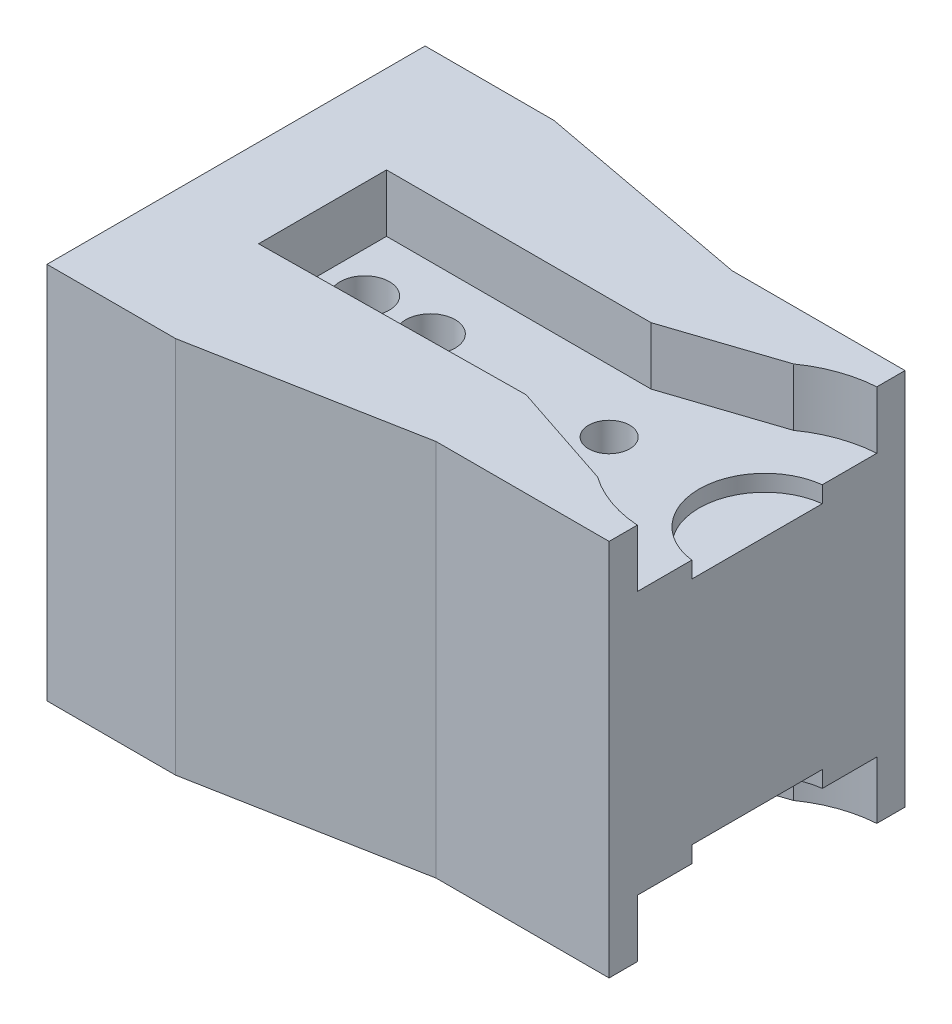
ISO-10303-21;
HEADER;
FILE_DESCRIPTION(('STEP AP214'),'2;1');
FILE_NAME('part.step','',(''),(''),'','','');
FILE_SCHEMA(('AUTOMOTIVE_DESIGN { 1 0 10303 214 1 1 1 1 }'));
ENDSEC;
DATA;
#1=APPLICATION_CONTEXT('core data for automotive mechanical design processes');
#2=APPLICATION_PROTOCOL_DEFINITION('international standard','automotive_design',2000,#1);
#3=PRODUCT_CONTEXT('',#1,'mechanical');
#4=PRODUCT('Part','Part','',(#3));
#5=PRODUCT_RELATED_PRODUCT_CATEGORY('part','',(#4));
#6=PRODUCT_DEFINITION_FORMATION('','',#4);
#7=PRODUCT_DEFINITION_CONTEXT('part definition',#1,'design');
#8=PRODUCT_DEFINITION('design','',#6,#7);
#9=PRODUCT_DEFINITION_SHAPE('','',#8);
#10=(LENGTH_UNIT() NAMED_UNIT(*) SI_UNIT(.MILLI.,.METRE.));
#11=(NAMED_UNIT(*) PLANE_ANGLE_UNIT() SI_UNIT($,.RADIAN.));
#12=(NAMED_UNIT(*) SI_UNIT($,.STERADIAN.) SOLID_ANGLE_UNIT());
#13=UNCERTAINTY_MEASURE_WITH_UNIT(LENGTH_MEASURE(1.E-05),#10,'distance_accuracy_value','');
#14=(GEOMETRIC_REPRESENTATION_CONTEXT(3) GLOBAL_UNCERTAINTY_ASSIGNED_CONTEXT((#13)) GLOBAL_UNIT_ASSIGNED_CONTEXT((#10,
#11,#12)) REPRESENTATION_CONTEXT('',''));
#15=CARTESIAN_POINT('',(0.,0.,0.));
#16=DIRECTION('',(0.,0.,1.));
#17=DIRECTION('',(1.,0.,0.));
#18=AXIS2_PLACEMENT_3D('',#15,#16,#17);
#19=CARTESIAN_POINT('',(7.30190903478725,8.,0.));
#20=DIRECTION('',(0.,-1.,0.));
#21=DIRECTION('',(0.,0.,-1.));
#22=AXIS2_PLACEMENT_3D('',#19,#20,#21);
#23=CYLINDRICAL_SURFACE('',#22,4.00000000000001);
#24=DIRECTION('',(0.,-1.,0.));
#25=VECTOR('',#24,1.);
#26=CARTESIAN_POINT('',(6.82431458586507,8.,-3.97138559477152));
#27=LINE('',#26,#25);
#28=CARTESIAN_POINT('',(6.82431458586507,-7.,-3.97138559477152));
#29=VERTEX_POINT('',#28);
#30=CARTESIAN_POINT('',(6.82431458586507,-8.,-3.97138559477152));
#31=VERTEX_POINT('',#30);
#32=EDGE_CURVE('E242',#29,#31,#27,.T.);
#33=ORIENTED_EDGE('',*,*,#32,.F.);
#34=CARTESIAN_POINT('',(7.30190903478725,-7.,0.));
#35=DIRECTION('',(0.,1.,0.));
#36=DIRECTION('',(0.,0.,1.));
#37=AXIS2_PLACEMENT_3D('',#34,#35,#36);
#38=CIRCLE('',#37,4.00000000000001);
#39=CARTESIAN_POINT('',(6.82431458586507,-7.,3.97138559477152));
#40=VERTEX_POINT('',#39);
#41=EDGE_CURVE('E225',#29,#40,#38,.T.);
#42=ORIENTED_EDGE('',*,*,#41,.T.);
#43=DIRECTION('',(0.,-1.,0.));
#44=VECTOR('',#43,1.);
#45=CARTESIAN_POINT('',(6.82431458586507,8.,3.97138559477152));
#46=LINE('',#45,#44);
#47=CARTESIAN_POINT('',(6.82431458586507,-8.,3.97138559477152));
#48=VERTEX_POINT('',#47);
#49=EDGE_CURVE('E241',#40,#48,#46,.T.);
#50=ORIENTED_EDGE('',*,*,#49,.T.);
#51=CARTESIAN_POINT('',(7.30190903478725,-8.,0.));
#52=DIRECTION('',(0.,1.,0.));
#53=DIRECTION('',(0.,0.,1.));
#54=AXIS2_PLACEMENT_3D('',#51,#52,#53);
#55=CIRCLE('',#54,4.00000000000001);
#56=EDGE_CURVE('E413',#31,#48,#55,.T.);
#57=ORIENTED_EDGE('',*,*,#56,.F.);
#58=EDGE_LOOP('',(#33,#42,#50,#57));
#59=FACE_BOUND('',#58,.T.);
#60=ADVANCED_FACE('F33',(#59),#23,.F.);
#61=CARTESIAN_POINT('',(7.30190903478725,11.5,0.));
#62=DIRECTION('',(0.,-1.,0.));
#63=DIRECTION('',(0.,0.,-1.));
#64=AXIS2_PLACEMENT_3D('',#61,#62,#63);
#65=CYLINDRICAL_SURFACE('',#64,7.3);
#66=DIRECTION('',(0.,-1.,0.));
#67=VECTOR('',#66,1.);
#68=CARTESIAN_POINT('',(3.08203544869912,11.5,5.9567329063368));
#69=LINE('',#68,#67);
#70=CARTESIAN_POINT('',(3.08203544869912,-8.,5.9567329063368));
#71=VERTEX_POINT('',#70);
#72=CARTESIAN_POINT('',(3.08203544869912,-11.5,5.9567329063368));
#73=VERTEX_POINT('',#72);
#74=EDGE_CURVE('E41',#71,#73,#69,.T.);
#75=ORIENTED_EDGE('',*,*,#74,.F.);
#76=CARTESIAN_POINT('',(7.30190903478725,-8.,0.));
#77=DIRECTION('',(0.,1.,0.));
#78=DIRECTION('',(0.,0.,1.));
#79=AXIS2_PLACEMENT_3D('',#76,#77,#78);
#80=CIRCLE('',#79,7.3);
#81=CARTESIAN_POINT('',(6.82431458586507,-8.,7.28436020130517));
#82=VERTEX_POINT('',#81);
#83=EDGE_CURVE('E419',#71,#82,#80,.T.);
#84=ORIENTED_EDGE('',*,*,#83,.T.);
#85=DIRECTION('',(0.,-1.,0.));
#86=VECTOR('',#85,1.);
#87=CARTESIAN_POINT('',(6.82431458586507,11.5,7.28436020130517));
#88=LINE('',#87,#86);
#89=CARTESIAN_POINT('',(6.82431458586507,-11.5,7.28436020130517));
#90=VERTEX_POINT('',#89);
#91=EDGE_CURVE('E335',#82,#90,#88,.T.);
#92=ORIENTED_EDGE('',*,*,#91,.T.);
#93=CARTESIAN_POINT('',(7.30190903478725,-11.5,0.));
#94=DIRECTION('',(0.,1.,0.));
#95=DIRECTION('',(0.,0.,1.));
#96=AXIS2_PLACEMENT_3D('',#93,#94,#95);
#97=CIRCLE('',#96,7.3);
#98=EDGE_CURVE('E250',#73,#90,#97,.T.);
#99=ORIENTED_EDGE('',*,*,#98,.F.);
#100=EDGE_LOOP('',(#75,#84,#92,#99));
#101=FACE_BOUND('',#100,.T.);
#102=ADVANCED_FACE('F503',(#101),#65,.F.);
#103=CARTESIAN_POINT('',(-1.47419364593529,11.5,4.44598450587265));
#104=DIRECTION('',(0.314728429496537,0.,-0.949181761132526));
#105=DIRECTION('',(-0.949181761132526,0.,-0.314728429496537));
#106=AXIS2_PLACEMENT_3D('',#103,#104,#105);
#107=PLANE('',#106);
#108=DIRECTION('',(0.,-1.,0.));
#109=VECTOR('',#108,1.);
#110=CARTESIAN_POINT('',(-3.42240249357379,11.5,3.8));
#111=LINE('',#110,#109);
#112=CARTESIAN_POINT('',(-3.42240249357379,-8.,3.8));
#113=VERTEX_POINT('',#112);
#114=CARTESIAN_POINT('',(-3.42240249357379,-11.5,3.8));
#115=VERTEX_POINT('',#114);
#116=EDGE_CURVE('E373',#113,#115,#111,.T.);
#117=ORIENTED_EDGE('',*,*,#116,.F.);
#118=DIRECTION('',(0.949181761132526,0.,0.314728429496537));
#119=VECTOR('',#118,1.);
#120=CARTESIAN_POINT('',(-1.47419364593529,-8.,4.44598450587265));
#121=LINE('',#120,#119);
#122=EDGE_CURVE('E55',#113,#71,#121,.T.);
#123=ORIENTED_EDGE('',*,*,#122,.T.);
#124=ORIENTED_EDGE('',*,*,#74,.T.);
#125=DIRECTION('',(0.949181761132526,0.,0.314728429496537));
#126=VECTOR('',#125,1.);
#127=CARTESIAN_POINT('',(-1.47419364593529,-11.5,4.44598450587265));
#128=LINE('',#127,#126);
#129=EDGE_CURVE('E294',#115,#73,#128,.T.);
#130=ORIENTED_EDGE('',*,*,#129,.F.);
#131=EDGE_LOOP('',(#117,#123,#124,#130));
#132=FACE_BOUND('',#131,.T.);
#133=ADVANCED_FACE('F384',(#132),#107,.T.);
#134=CARTESIAN_POINT('',(0.04266264544043,11.5,3.76069104220616));
#135=DIRECTION('',(-0.0113436333910476,0.,-0.999935658920857));
#136=DIRECTION('',(-0.999935658920858,0.,0.0113436333910476));
#137=AXIS2_PLACEMENT_3D('',#134,#135,#136);
#138=PLANE('',#137);
#139=DIRECTION('',(0.,-1.,0.));
#140=VECTOR('',#139,1.);
#141=CARTESIAN_POINT('',(-19.5134483009202,11.5,3.98254266950944));
#142=LINE('',#141,#140);
#143=CARTESIAN_POINT('',(-19.5134483009202,-8.,3.98254266950944));
#144=VERTEX_POINT('',#143);
#145=CARTESIAN_POINT('',(-19.5134483009202,-11.5,3.98254266950944));
#146=VERTEX_POINT('',#145);
#147=EDGE_CURVE('E370',#144,#146,#142,.T.);
#148=ORIENTED_EDGE('',*,*,#147,.F.);
#149=DIRECTION('',(0.999935658920858,0.,-0.0113436333910476));
#150=VECTOR('',#149,1.);
#151=CARTESIAN_POINT('',(0.04266264544043,-8.,3.76069104220616));
#152=LINE('',#151,#150);
#153=EDGE_CURVE('E247',#144,#113,#152,.T.);
#154=ORIENTED_EDGE('',*,*,#153,.T.);
#155=ORIENTED_EDGE('',*,*,#116,.T.);
#156=DIRECTION('',(0.999935658920858,0.,-0.0113436333910476));
#157=VECTOR('',#156,1.);
#158=CARTESIAN_POINT('',(0.04266264544043,-11.5,3.76069104220616));
#159=LINE('',#158,#157);
#160=EDGE_CURVE('E297',#146,#115,#159,.T.);
#161=ORIENTED_EDGE('',*,*,#160,.F.);
#162=EDGE_LOOP('',(#148,#154,#155,#161));
#163=FACE_BOUND('',#162,.T.);
#164=ADVANCED_FACE('F382',(#163),#138,.T.);
#165=CARTESIAN_POINT('',(-19.5134483009202,11.5,0.));
#166=DIRECTION('',(1.,0.,0.));
#167=DIRECTION('',(0.,0.,-1.));
#168=AXIS2_PLACEMENT_3D('',#165,#166,#167);
#169=PLANE('',#168);
#170=DIRECTION('',(0.,-1.,0.));
#171=VECTOR('',#170,1.);
#172=CARTESIAN_POINT('',(-19.5134483009202,11.5,-3.8));
#173=LINE('',#172,#171);
#174=CARTESIAN_POINT('',(-19.5134483009202,-8.,-3.8));
#175=VERTEX_POINT('',#174);
#176=CARTESIAN_POINT('',(-19.5134483009202,-11.5,-3.8));
#177=VERTEX_POINT('',#176);
#178=EDGE_CURVE('E366',#175,#177,#173,.T.);
#179=ORIENTED_EDGE('',*,*,#178,.F.);
#180=DIRECTION('',(0.,0.,1.));
#181=VECTOR('',#180,1.);
#182=CARTESIAN_POINT('',(-19.5134483009202,-8.,0.));
#183=LINE('',#182,#181);
#184=EDGE_CURVE('E395',#175,#144,#183,.T.);
#185=ORIENTED_EDGE('',*,*,#184,.T.);
#186=ORIENTED_EDGE('',*,*,#147,.T.);
#187=DIRECTION('',(0.,0.,1.));
#188=VECTOR('',#187,1.);
#189=CARTESIAN_POINT('',(-19.5134483009202,-11.5,0.));
#190=LINE('',#189,#188);
#191=EDGE_CURVE('E300',#177,#146,#190,.T.);
#192=ORIENTED_EDGE('',*,*,#191,.F.);
#193=EDGE_LOOP('',(#179,#185,#186,#192));
#194=FACE_BOUND('',#193,.T.);
#195=ADVANCED_FACE('F393',(#194),#169,.T.);
#196=CARTESIAN_POINT('',(0.,11.5,-3.8));
#197=DIRECTION('',(0.,0.,1.));
#198=DIRECTION('',(1.,0.,0.));
#199=AXIS2_PLACEMENT_3D('',#196,#197,#198);
#200=PLANE('',#199);
#201=DIRECTION('',(0.,-1.,0.));
#202=VECTOR('',#201,1.);
#203=CARTESIAN_POINT('',(-3.42240249357379,11.5,-3.8));
#204=LINE('',#203,#202);
#205=CARTESIAN_POINT('',(-3.42240249357379,-8.,-3.8));
#206=VERTEX_POINT('',#205);
#207=CARTESIAN_POINT('',(-3.42240249357379,-11.5,-3.8));
#208=VERTEX_POINT('',#207);
#209=EDGE_CURVE('E362',#206,#208,#204,.T.);
#210=ORIENTED_EDGE('',*,*,#209,.F.);
#211=DIRECTION('',(-1.,0.,0.));
#212=VECTOR('',#211,1.);
#213=CARTESIAN_POINT('',(0.,-8.,-3.8));
#214=LINE('',#213,#212);
#215=EDGE_CURVE('E404',#206,#175,#214,.T.);
#216=ORIENTED_EDGE('',*,*,#215,.T.);
#217=ORIENTED_EDGE('',*,*,#178,.T.);
#218=DIRECTION('',(-1.,0.,0.));
#219=VECTOR('',#218,1.);
#220=CARTESIAN_POINT('',(0.,-11.5,-3.8));
#221=LINE('',#220,#219);
#222=EDGE_CURVE('E303',#208,#177,#221,.T.);
#223=ORIENTED_EDGE('',*,*,#222,.F.);
#224=EDGE_LOOP('',(#210,#216,#217,#223));
#225=FACE_BOUND('',#224,.T.);
#226=ADVANCED_FACE('F619',(#225),#200,.T.);
#227=CARTESIAN_POINT('',(-1.47419364593529,11.5,-4.44598450587265));
#228=DIRECTION('',(-0.314728429496537,0.,-0.949181761132526));
#229=DIRECTION('',(-0.949181761132526,0.,0.314728429496537));
#230=AXIS2_PLACEMENT_3D('',#227,#228,#229);
#231=PLANE('',#230);
#232=DIRECTION('',(0.949181761132526,0.,-0.314728429496537));
#233=VECTOR('',#232,1.);
#234=CARTESIAN_POINT('',(-1.47419364593529,-8.,-4.44598450587265));
#235=LINE('',#234,#233);
#236=CARTESIAN_POINT('',(3.08203544869912,-8.,-5.9567329063368));
#237=VERTEX_POINT('',#236);
#238=EDGE_CURVE('E405',#206,#237,#235,.T.);
#239=ORIENTED_EDGE('',*,*,#238,.F.);
#240=ORIENTED_EDGE('',*,*,#209,.T.);
#241=DIRECTION('',(0.949181761132526,0.,-0.314728429496537));
#242=VECTOR('',#241,1.);
#243=CARTESIAN_POINT('',(-1.47419364593529,-11.5,-4.44598450587265));
#244=LINE('',#243,#242);
#245=CARTESIAN_POINT('',(3.08203544869912,-11.5,-5.9567329063368));
#246=VERTEX_POINT('',#245);
#247=EDGE_CURVE('E306',#208,#246,#244,.T.);
#248=ORIENTED_EDGE('',*,*,#247,.T.);
#249=DIRECTION('',(0.,-1.,0.));
#250=VECTOR('',#249,1.);
#251=CARTESIAN_POINT('',(3.08203544869912,11.5,-5.9567329063368));
#252=LINE('',#251,#250);
#253=EDGE_CURVE('E358',#237,#246,#252,.T.);
#254=ORIENTED_EDGE('',*,*,#253,.F.);
#255=EDGE_LOOP('',(#239,#240,#248,#254));
#256=FACE_BOUND('',#255,.T.);
#257=ADVANCED_FACE('F629',(#256),#231,.F.);
#258=CARTESIAN_POINT('',(7.30190903478725,11.5,0.));
#259=DIRECTION('',(0.,-1.,0.));
#260=DIRECTION('',(0.,0.,-1.));
#261=AXIS2_PLACEMENT_3D('',#258,#259,#260);
#262=CYLINDRICAL_SURFACE('',#261,7.3);
#263=DIRECTION('',(0.,-1.,0.));
#264=VECTOR('',#263,1.);
#265=CARTESIAN_POINT('',(6.82431458586507,11.5,-7.28436020130517));
#266=LINE('',#265,#264);
#267=CARTESIAN_POINT('',(6.82431458586507,-8.,-7.28436020130517));
#268=VERTEX_POINT('',#267);
#269=CARTESIAN_POINT('',(6.82431458586507,-11.5,-7.28436020130517));
#270=VERTEX_POINT('',#269);
#271=EDGE_CURVE('E355',#268,#270,#266,.T.);
#272=ORIENTED_EDGE('',*,*,#271,.F.);
#273=CARTESIAN_POINT('',(7.30190903478725,-8.,0.));
#274=DIRECTION('',(0.,1.,0.));
#275=DIRECTION('',(0.,0.,1.));
#276=AXIS2_PLACEMENT_3D('',#273,#274,#275);
#277=CIRCLE('',#276,7.3);
#278=EDGE_CURVE('E410',#268,#237,#277,.T.);
#279=ORIENTED_EDGE('',*,*,#278,.T.);
#280=ORIENTED_EDGE('',*,*,#253,.T.);
#281=CARTESIAN_POINT('',(7.30190903478725,-11.5,0.));
#282=DIRECTION('',(0.,1.,0.));
#283=DIRECTION('',(0.,0.,1.));
#284=AXIS2_PLACEMENT_3D('',#281,#282,#283);
#285=CIRCLE('',#284,7.3);
#286=EDGE_CURVE('E309',#270,#246,#285,.T.);
#287=ORIENTED_EDGE('',*,*,#286,.F.);
#288=EDGE_LOOP('',(#272,#279,#280,#287));
#289=FACE_BOUND('',#288,.T.);
#290=ADVANCED_FACE('F471',(#289),#262,.F.);
#291=CARTESIAN_POINT('',(7.30190903478725,8.,0.));
#292=DIRECTION('',(0.,1.,0.));
#293=DIRECTION('',(0.,0.,1.));
#294=AXIS2_PLACEMENT_3D('',#291,#292,#293);
#295=CIRCLE('',#294,7.3);
#296=CARTESIAN_POINT('',(3.08203544869912,8.,5.9567329063368));
#297=VERTEX_POINT('',#296);
#298=CARTESIAN_POINT('',(6.82431458586507,8.,7.28436020130517));
#299=VERTEX_POINT('',#298);
#300=EDGE_CURVE('E448',#297,#299,#295,.T.);
#301=ORIENTED_EDGE('',*,*,#300,.F.);
#302=CARTESIAN_POINT('',(3.08203544869912,11.5,5.9567329063368));
#303=VERTEX_POINT('',#302);
#304=EDGE_CURVE('E11',#303,#297,#69,.T.);
#305=ORIENTED_EDGE('',*,*,#304,.F.);
#306=CARTESIAN_POINT('',(7.30190903478725,11.5,0.));
#307=DIRECTION('',(0.,1.,0.));
#308=DIRECTION('',(0.,0.,1.));
#309=AXIS2_PLACEMENT_3D('',#306,#307,#308);
#310=CIRCLE('',#309,7.3);
#311=CARTESIAN_POINT('',(6.82431458586507,11.5,7.28436020130517));
#312=VERTEX_POINT('',#311);
#313=EDGE_CURVE('E251',#303,#312,#310,.T.);
#314=ORIENTED_EDGE('',*,*,#313,.T.);
#315=EDGE_CURVE('E332',#312,#299,#88,.T.);
#316=ORIENTED_EDGE('',*,*,#315,.T.);
#317=EDGE_LOOP('',(#301,#305,#314,#316));
#318=FACE_BOUND('',#317,.T.);
#319=ADVANCED_FACE('F35',(#318),#65,.F.);
#320=DIRECTION('',(0.949181761132526,0.,0.314728429496537));
#321=VECTOR('',#320,1.);
#322=CARTESIAN_POINT('',(-1.47419364593529,8.,4.44598450587265));
#323=LINE('',#322,#321);
#324=CARTESIAN_POINT('',(-3.42240249357379,8.,3.8));
#325=VERTEX_POINT('',#324);
#326=EDGE_CURVE('E451',#325,#297,#323,.T.);
#327=ORIENTED_EDGE('',*,*,#326,.F.);
#328=CARTESIAN_POINT('',(-3.42240249357379,11.5,3.8));
#329=VERTEX_POINT('',#328);
#330=EDGE_CURVE('E374',#329,#325,#111,.T.);
#331=ORIENTED_EDGE('',*,*,#330,.F.);
#332=DIRECTION('',(0.949181761132526,0.,0.314728429496537));
#333=VECTOR('',#332,1.);
#334=CARTESIAN_POINT('',(-1.47419364593529,11.5,4.44598450587265));
#335=LINE('',#334,#333);
#336=EDGE_CURVE('E254',#329,#303,#335,.T.);
#337=ORIENTED_EDGE('',*,*,#336,.T.);
#338=ORIENTED_EDGE('',*,*,#304,.T.);
#339=EDGE_LOOP('',(#327,#331,#337,#338));
#340=FACE_BOUND('',#339,.T.);
#341=ADVANCED_FACE('F602',(#340),#107,.T.);
#342=DIRECTION('',(0.999935658920858,0.,-0.0113436333910476));
#343=VECTOR('',#342,1.);
#344=CARTESIAN_POINT('',(0.04266264544043,8.,3.76069104220616));
#345=LINE('',#344,#343);
#346=CARTESIAN_POINT('',(-19.5134483009202,8.,3.98254266950944));
#347=VERTEX_POINT('',#346);
#348=EDGE_CURVE('E245',#347,#325,#345,.T.);
#349=ORIENTED_EDGE('',*,*,#348,.F.);
#350=CARTESIAN_POINT('',(-19.5134483009202,11.5,3.98254266950944));
#351=VERTEX_POINT('',#350);
#352=EDGE_CURVE('E371',#351,#347,#142,.T.);
#353=ORIENTED_EDGE('',*,*,#352,.F.);
#354=DIRECTION('',(0.999935658920858,0.,-0.0113436333910476));
#355=VECTOR('',#354,1.);
#356=CARTESIAN_POINT('',(0.04266264544043,11.5,3.76069104220616));
#357=LINE('',#356,#355);
#358=EDGE_CURVE('E258',#351,#329,#357,.T.);
#359=ORIENTED_EDGE('',*,*,#358,.T.);
#360=ORIENTED_EDGE('',*,*,#330,.T.);
#361=EDGE_LOOP('',(#349,#353,#359,#360));
#362=FACE_BOUND('',#361,.T.);
#363=ADVANCED_FACE('F611',(#362),#138,.T.);
#364=DIRECTION('',(0.,0.,1.));
#365=VECTOR('',#364,1.);
#366=CARTESIAN_POINT('',(-19.5134483009202,8.,0.));
#367=LINE('',#366,#365);
#368=CARTESIAN_POINT('',(-19.5134483009202,8.,-3.8));
#369=VERTEX_POINT('',#368);
#370=EDGE_CURVE('E432',#369,#347,#367,.T.);
#371=ORIENTED_EDGE('',*,*,#370,.F.);
#372=CARTESIAN_POINT('',(-19.5134483009202,11.5,-3.8));
#373=VERTEX_POINT('',#372);
#374=EDGE_CURVE('E367',#373,#369,#173,.T.);
#375=ORIENTED_EDGE('',*,*,#374,.F.);
#376=DIRECTION('',(0.,0.,1.));
#377=VECTOR('',#376,1.);
#378=CARTESIAN_POINT('',(-19.5134483009202,11.5,0.));
#379=LINE('',#378,#377);
#380=EDGE_CURVE('E261',#373,#351,#379,.T.);
#381=ORIENTED_EDGE('',*,*,#380,.T.);
#382=ORIENTED_EDGE('',*,*,#352,.T.);
#383=EDGE_LOOP('',(#371,#375,#381,#382));
#384=FACE_BOUND('',#383,.T.);
#385=ADVANCED_FACE('F621',(#384),#169,.T.);
#386=DIRECTION('',(-1.,0.,0.));
#387=VECTOR('',#386,1.);
#388=CARTESIAN_POINT('',(0.,8.,-3.8));
#389=LINE('',#388,#387);
#390=CARTESIAN_POINT('',(-3.42240249357379,8.,-3.8));
#391=VERTEX_POINT('',#390);
#392=EDGE_CURVE('E435',#391,#369,#389,.T.);
#393=ORIENTED_EDGE('',*,*,#392,.F.);
#394=CARTESIAN_POINT('',(-3.42240249357379,11.5,-3.8));
#395=VERTEX_POINT('',#394);
#396=EDGE_CURVE('E363',#395,#391,#204,.T.);
#397=ORIENTED_EDGE('',*,*,#396,.F.);
#398=DIRECTION('',(-1.,0.,0.));
#399=VECTOR('',#398,1.);
#400=CARTESIAN_POINT('',(0.,11.5,-3.8));
#401=LINE('',#400,#399);
#402=EDGE_CURVE('E264',#395,#373,#401,.T.);
#403=ORIENTED_EDGE('',*,*,#402,.T.);
#404=ORIENTED_EDGE('',*,*,#374,.T.);
#405=EDGE_LOOP('',(#393,#397,#403,#404));
#406=FACE_BOUND('',#405,.T.);
#407=ADVANCED_FACE('F632',(#406),#200,.T.);
#408=ORIENTED_EDGE('',*,*,#396,.T.);
#409=DIRECTION('',(0.949181761132526,0.,-0.314728429496537));
#410=VECTOR('',#409,1.);
#411=CARTESIAN_POINT('',(-1.47419364593529,8.,-4.44598450587265));
#412=LINE('',#411,#410);
#413=CARTESIAN_POINT('',(3.08203544869912,8.,-5.9567329063368));
#414=VERTEX_POINT('',#413);
#415=EDGE_CURVE('E438',#391,#414,#412,.T.);
#416=ORIENTED_EDGE('',*,*,#415,.T.);
#417=CARTESIAN_POINT('',(3.08203544869912,11.5,-5.9567329063368));
#418=VERTEX_POINT('',#417);
#419=EDGE_CURVE('E359',#418,#414,#252,.T.);
#420=ORIENTED_EDGE('',*,*,#419,.F.);
#421=DIRECTION('',(0.949181761132526,0.,-0.314728429496537));
#422=VECTOR('',#421,1.);
#423=CARTESIAN_POINT('',(-1.47419364593529,11.5,-4.44598450587265));
#424=LINE('',#423,#422);
#425=EDGE_CURVE('E267',#395,#418,#424,.T.);
#426=ORIENTED_EDGE('',*,*,#425,.F.);
#427=EDGE_LOOP('',(#408,#416,#420,#426));
#428=FACE_BOUND('',#427,.T.);
#429=ADVANCED_FACE('F642',(#428),#231,.F.);
#430=CARTESIAN_POINT('',(7.30190903478725,8.,0.));
#431=DIRECTION('',(0.,1.,0.));
#432=DIRECTION('',(0.,0.,1.));
#433=AXIS2_PLACEMENT_3D('',#430,#431,#432);
#434=CIRCLE('',#433,7.3);
#435=CARTESIAN_POINT('',(6.82431458586507,8.,-7.28436020130517));
#436=VERTEX_POINT('',#435);
#437=EDGE_CURVE('E440',#436,#414,#434,.T.);
#438=ORIENTED_EDGE('',*,*,#437,.F.);
#439=CARTESIAN_POINT('',(6.82431458586507,11.5,-7.28436020130517));
#440=VERTEX_POINT('',#439);
#441=EDGE_CURVE('E356',#440,#436,#266,.T.);
#442=ORIENTED_EDGE('',*,*,#441,.F.);
#443=CARTESIAN_POINT('',(7.30190903478725,11.5,0.));
#444=DIRECTION('',(0.,1.,0.));
#445=DIRECTION('',(0.,0.,1.));
#446=AXIS2_PLACEMENT_3D('',#443,#444,#445);
#447=CIRCLE('',#446,7.3);
#448=EDGE_CURVE('E269',#440,#418,#447,.T.);
#449=ORIENTED_EDGE('',*,*,#448,.T.);
#450=ORIENTED_EDGE('',*,*,#419,.T.);
#451=EDGE_LOOP('',(#438,#442,#449,#450));
#452=FACE_BOUND('',#451,.T.);
#453=ADVANCED_FACE('F650',(#452),#262,.F.);
#454=CARTESIAN_POINT('',(0.,11.5,-9.00020273985315));
#455=DIRECTION('',(0.,0.,1.));
#456=DIRECTION('',(1.,0.,0.));
#457=AXIS2_PLACEMENT_3D('',#454,#455,#456);
#458=PLANE('',#457);
#459=DIRECTION('',(-1.,0.,0.));
#460=VECTOR('',#459,1.);
#461=CARTESIAN_POINT('',(0.,-11.5,-9.00020273985315));
#462=LINE('',#461,#460);
#463=CARTESIAN_POINT('',(6.82431458586507,-11.5,-9.00020273985315));
#464=VERTEX_POINT('',#463);
#465=CARTESIAN_POINT('',(-3.69046730858752,-11.5,-9.00020273985315));
#466=VERTEX_POINT('',#465);
#467=EDGE_CURVE('E315',#464,#466,#462,.T.);
#468=ORIENTED_EDGE('',*,*,#467,.T.);
#469=DIRECTION('',(0.,-1.,0.));
#470=VECTOR('',#469,1.);
#471=CARTESIAN_POINT('',(-3.69046730858752,11.5,-9.00020273985315));
#472=LINE('',#471,#470);
#473=CARTESIAN_POINT('',(-3.69046730858752,11.5,-9.00020273985315));
#474=VERTEX_POINT('',#473);
#475=EDGE_CURVE('E350',#474,#466,#472,.T.);
#476=ORIENTED_EDGE('',*,*,#475,.F.);
#477=DIRECTION('',(-1.,0.,0.));
#478=VECTOR('',#477,1.);
#479=CARTESIAN_POINT('',(0.,11.5,-9.00020273985315));
#480=LINE('',#479,#478);
#481=CARTESIAN_POINT('',(6.82431458586507,11.5,-9.00020273985315));
#482=VERTEX_POINT('',#481);
#483=EDGE_CURVE('E275',#482,#474,#480,.T.);
#484=ORIENTED_EDGE('',*,*,#483,.F.);
#485=DIRECTION('',(0.,-1.,0.));
#486=VECTOR('',#485,1.);
#487=CARTESIAN_POINT('',(6.82431458586507,11.5,-9.00020273985315));
#488=LINE('',#487,#486);
#489=EDGE_CURVE('E353',#482,#464,#488,.T.);
#490=ORIENTED_EDGE('',*,*,#489,.T.);
#491=EDGE_LOOP('',(#468,#476,#484,#490));
#492=FACE_BOUND('',#491,.T.);
#493=ADVANCED_FACE('F478',(#492),#458,.F.);
#494=CARTESIAN_POINT('',(1.50337852196796,11.5,-8.02750779271728));
#495=DIRECTION('',(-0.184078080330456,0.,0.982911623871574));
#496=DIRECTION('',(0.982911623871574,0.,0.184078080330456));
#497=AXIS2_PLACEMENT_3D('',#494,#495,#496);
#498=PLANE('',#497);
#499=DIRECTION('',(-0.982911623871574,0.,-0.184078080330456));
#500=VECTOR('',#499,1.);
#501=CARTESIAN_POINT('',(1.50337852196796,-11.5,-8.02750779271728));
#502=LINE('',#501,#500);
#503=CARTESIAN_POINT('',(-17.0384975570001,-11.5,-11.5));
#504=VERTEX_POINT('',#503);
#505=EDGE_CURVE('E317',#466,#504,#502,.T.);
#506=ORIENTED_EDGE('',*,*,#505,.T.);
#507=DIRECTION('',(0.,-1.,0.));
#508=VECTOR('',#507,1.);
#509=CARTESIAN_POINT('',(-17.0384975570001,11.5,-11.5));
#510=LINE('',#509,#508);
#511=CARTESIAN_POINT('',(-17.0384975570001,11.5,-11.5));
#512=VERTEX_POINT('',#511);
#513=EDGE_CURVE('E347',#512,#504,#510,.T.);
#514=ORIENTED_EDGE('',*,*,#513,.F.);
#515=DIRECTION('',(-0.982911623871574,0.,-0.184078080330456));
#516=VECTOR('',#515,1.);
#517=CARTESIAN_POINT('',(1.50337852196796,11.5,-8.02750779271728));
#518=LINE('',#517,#516);
#519=EDGE_CURVE('E278',#474,#512,#518,.T.);
#520=ORIENTED_EDGE('',*,*,#519,.F.);
#521=ORIENTED_EDGE('',*,*,#475,.T.);
#522=EDGE_LOOP('',(#506,#514,#520,#521));
#523=FACE_BOUND('',#522,.T.);
#524=ADVANCED_FACE('F482',(#523),#498,.F.);
#525=CARTESIAN_POINT('',(0.,11.5,-11.5));
#526=DIRECTION('',(0.,0.,1.));
#527=DIRECTION('',(1.,0.,0.));
#528=AXIS2_PLACEMENT_3D('',#525,#526,#527);
#529=PLANE('',#528);
#530=DIRECTION('',(-1.,0.,0.));
#531=VECTOR('',#530,1.);
#532=CARTESIAN_POINT('',(0.,-11.5,-11.5));
#533=LINE('',#532,#531);
#534=CARTESIAN_POINT('',(-24.8679714874678,-11.5,-11.5));
#535=VERTEX_POINT('',#534);
#536=EDGE_CURVE('E319',#504,#535,#533,.T.);
#537=ORIENTED_EDGE('',*,*,#536,.T.);
#538=DIRECTION('',(0.,-1.,0.));
#539=VECTOR('',#538,1.);
#540=CARTESIAN_POINT('',(-24.8679714874678,11.5,-11.5));
#541=LINE('',#540,#539);
#542=CARTESIAN_POINT('',(-24.8679714874678,11.5,-11.5));
#543=VERTEX_POINT('',#542);
#544=EDGE_CURVE('E344',#543,#535,#541,.T.);
#545=ORIENTED_EDGE('',*,*,#544,.F.);
#546=DIRECTION('',(-1.,0.,0.));
#547=VECTOR('',#546,1.);
#548=CARTESIAN_POINT('',(0.,11.5,-11.5));
#549=LINE('',#548,#547);
#550=EDGE_CURVE('E280',#512,#543,#549,.T.);
#551=ORIENTED_EDGE('',*,*,#550,.F.);
#552=ORIENTED_EDGE('',*,*,#513,.T.);
#553=EDGE_LOOP('',(#537,#545,#551,#552));
#554=FACE_BOUND('',#553,.T.);
#555=ADVANCED_FACE('F522',(#554),#529,.F.);
#556=CARTESIAN_POINT('',(-24.8679714874678,11.5,0.));
#557=DIRECTION('',(1.,0.,0.));
#558=DIRECTION('',(0.,0.,-1.));
#559=AXIS2_PLACEMENT_3D('',#556,#557,#558);
#560=PLANE('',#559);
#561=DIRECTION('',(0.,0.,1.));
#562=VECTOR('',#561,1.);
#563=CARTESIAN_POINT('',(-24.8679714874678,-11.5,0.));
#564=LINE('',#563,#562);
#565=CARTESIAN_POINT('',(-24.8679714874678,-11.5,11.5));
#566=VERTEX_POINT('',#565);
#567=EDGE_CURVE('E321',#535,#566,#564,.T.);
#568=ORIENTED_EDGE('',*,*,#567,.T.);
#569=DIRECTION('',(0.,-1.,0.));
#570=VECTOR('',#569,1.);
#571=CARTESIAN_POINT('',(-24.8679714874678,11.5,11.5));
#572=LINE('',#571,#570);
#573=CARTESIAN_POINT('',(-24.8679714874678,11.5,11.5));
#574=VERTEX_POINT('',#573);
#575=EDGE_CURVE('E341',#574,#566,#572,.T.);
#576=ORIENTED_EDGE('',*,*,#575,.F.);
#577=DIRECTION('',(0.,0.,1.));
#578=VECTOR('',#577,1.);
#579=CARTESIAN_POINT('',(-24.8679714874678,11.5,0.));
#580=LINE('',#579,#578);
#581=EDGE_CURVE('E282',#543,#574,#580,.T.);
#582=ORIENTED_EDGE('',*,*,#581,.F.);
#583=ORIENTED_EDGE('',*,*,#544,.T.);
#584=EDGE_LOOP('',(#568,#576,#582,#583));
#585=FACE_BOUND('',#584,.T.);
#586=ADVANCED_FACE('F520',(#585),#560,.F.);
#587=CARTESIAN_POINT('',(0.,11.5,11.5));
#588=DIRECTION('',(0.,0.,-1.));
#589=DIRECTION('',(-1.,0.,0.));
#590=AXIS2_PLACEMENT_3D('',#587,#588,#589);
#591=PLANE('',#590);
#592=DIRECTION('',(1.,0.,0.));
#593=VECTOR('',#592,1.);
#594=CARTESIAN_POINT('',(0.,-11.5,11.5));
#595=LINE('',#594,#593);
#596=CARTESIAN_POINT('',(-17.0384975570001,-11.5,11.5));
#597=VERTEX_POINT('',#596);
#598=EDGE_CURVE('E323',#566,#597,#595,.T.);
#599=ORIENTED_EDGE('',*,*,#598,.T.);
#600=DIRECTION('',(0.,-1.,0.));
#601=VECTOR('',#600,1.);
#602=CARTESIAN_POINT('',(-17.0384975570001,11.5,11.5));
#603=LINE('',#602,#601);
#604=CARTESIAN_POINT('',(-17.0384975570001,11.5,11.5));
#605=VERTEX_POINT('',#604);
#606=EDGE_CURVE('E339',#605,#597,#603,.T.);
#607=ORIENTED_EDGE('',*,*,#606,.F.);
#608=DIRECTION('',(1.,0.,0.));
#609=VECTOR('',#608,1.);
#610=CARTESIAN_POINT('',(0.,11.5,11.5));
#611=LINE('',#610,#609);
#612=EDGE_CURVE('E284',#574,#605,#611,.T.);
#613=ORIENTED_EDGE('',*,*,#612,.F.);
#614=ORIENTED_EDGE('',*,*,#575,.T.);
#615=EDGE_LOOP('',(#599,#607,#613,#614));
#616=FACE_BOUND('',#615,.T.);
#617=ADVANCED_FACE('F516',(#616),#591,.F.);
#618=CARTESIAN_POINT('',(1.50337852196796,11.5,8.02750779271727));
#619=DIRECTION('',(0.184078080330457,0.,0.982911623871574));
#620=DIRECTION('',(0.982911623871574,0.,-0.184078080330457));
#621=AXIS2_PLACEMENT_3D('',#618,#619,#620);
#622=PLANE('',#621);
#623=DIRECTION('',(-0.982911623871574,0.,0.184078080330457));
#624=VECTOR('',#623,1.);
#625=CARTESIAN_POINT('',(1.50337852196796,-11.5,8.02750779271727));
#626=LINE('',#625,#624);
#627=CARTESIAN_POINT('',(-3.69046730858752,-11.5,9.00020273985315));
#628=VERTEX_POINT('',#627);
#629=EDGE_CURVE('E326',#628,#597,#626,.T.);
#630=ORIENTED_EDGE('',*,*,#629,.F.);
#631=DIRECTION('',(0.,-1.,0.));
#632=VECTOR('',#631,1.);
#633=CARTESIAN_POINT('',(-3.69046730858752,11.5,9.00020273985315));
#634=LINE('',#633,#632);
#635=CARTESIAN_POINT('',(-3.69046730858752,11.5,9.00020273985315));
#636=VERTEX_POINT('',#635);
#637=EDGE_CURVE('E337',#636,#628,#634,.T.);
#638=ORIENTED_EDGE('',*,*,#637,.F.);
#639=DIRECTION('',(-0.982911623871574,0.,0.184078080330457));
#640=VECTOR('',#639,1.);
#641=CARTESIAN_POINT('',(1.50337852196796,11.5,8.02750779271727));
#642=LINE('',#641,#640);
#643=EDGE_CURVE('E286',#636,#605,#642,.T.);
#644=ORIENTED_EDGE('',*,*,#643,.T.);
#645=ORIENTED_EDGE('',*,*,#606,.T.);
#646=EDGE_LOOP('',(#630,#638,#644,#645));
#647=FACE_BOUND('',#646,.T.);
#648=ADVANCED_FACE('F512',(#647),#622,.T.);
#649=CARTESIAN_POINT('',(0.,11.5,9.00020273985315));
#650=DIRECTION('',(0.,0.,1.));
#651=DIRECTION('',(1.,0.,0.));
#652=AXIS2_PLACEMENT_3D('',#649,#650,#651);
#653=PLANE('',#652);
#654=DIRECTION('',(-1.,0.,0.));
#655=VECTOR('',#654,1.);
#656=CARTESIAN_POINT('',(0.,-11.5,9.00020273985315));
#657=LINE('',#656,#655);
#658=CARTESIAN_POINT('',(6.82431458586507,-11.5,9.00020273985315));
#659=VERTEX_POINT('',#658);
#660=EDGE_CURVE('E329',#659,#628,#657,.T.);
#661=ORIENTED_EDGE('',*,*,#660,.F.);
#662=DIRECTION('',(0.,-1.,0.));
#663=VECTOR('',#662,1.);
#664=CARTESIAN_POINT('',(6.82431458586507,11.5,9.00020273985315));
#665=LINE('',#664,#663);
#666=CARTESIAN_POINT('',(6.82431458586507,11.5,9.00020273985315));
#667=VERTEX_POINT('',#666);
#668=EDGE_CURVE('E334',#667,#659,#665,.T.);
#669=ORIENTED_EDGE('',*,*,#668,.F.);
#670=DIRECTION('',(-1.,0.,0.));
#671=VECTOR('',#670,1.);
#672=CARTESIAN_POINT('',(0.,11.5,9.00020273985315));
#673=LINE('',#672,#671);
#674=EDGE_CURVE('E289',#667,#636,#673,.T.);
#675=ORIENTED_EDGE('',*,*,#674,.T.);
#676=ORIENTED_EDGE('',*,*,#637,.T.);
#677=EDGE_LOOP('',(#661,#669,#675,#676));
#678=FACE_BOUND('',#677,.T.);
#679=ADVANCED_FACE('F507',(#678),#653,.T.);
#680=CARTESIAN_POINT('',(6.82431458586507,11.5,0.));
#681=DIRECTION('',(1.,0.,0.));
#682=DIRECTION('',(0.,0.,-1.));
#683=AXIS2_PLACEMENT_3D('',#680,#681,#682);
#684=PLANE('',#683);
#685=DIRECTION('',(0.,0.,1.));
#686=VECTOR('',#685,1.);
#687=CARTESIAN_POINT('',(6.82431458586507,-11.5,0.));
#688=LINE('',#687,#686);
#689=EDGE_CURVE('E255',#90,#659,#688,.T.);
#690=ORIENTED_EDGE('',*,*,#689,.F.);
#691=ORIENTED_EDGE('',*,*,#91,.F.);
#692=DIRECTION('',(0.,0.,1.));
#693=VECTOR('',#692,1.);
#694=CARTESIAN_POINT('',(6.82431458586507,-8.,0.));
#695=LINE('',#694,#693);
#696=EDGE_CURVE('E416',#48,#82,#695,.T.);
#697=ORIENTED_EDGE('',*,*,#696,.F.);
#698=ORIENTED_EDGE('',*,*,#49,.F.);
#699=DIRECTION('',(0.,0.,1.));
#700=VECTOR('',#699,1.);
#701=CARTESIAN_POINT('',(6.82431458586507,-7.,0.));
#702=LINE('',#701,#700);
#703=EDGE_CURVE('E47',#29,#40,#702,.T.);
#704=ORIENTED_EDGE('',*,*,#703,.F.);
#705=ORIENTED_EDGE('',*,*,#32,.T.);
#706=EDGE_CURVE('E412',#268,#31,#695,.T.);
#707=ORIENTED_EDGE('',*,*,#706,.F.);
#708=ORIENTED_EDGE('',*,*,#271,.T.);
#709=EDGE_CURVE('E312',#464,#270,#688,.T.);
#710=ORIENTED_EDGE('',*,*,#709,.F.);
#711=ORIENTED_EDGE('',*,*,#489,.F.);
#712=DIRECTION('',(0.,0.,1.));
#713=VECTOR('',#712,1.);
#714=CARTESIAN_POINT('',(6.82431458586507,11.5,0.));
#715=LINE('',#714,#713);
#716=EDGE_CURVE('E272',#482,#440,#715,.T.);
#717=ORIENTED_EDGE('',*,*,#716,.T.);
#718=ORIENTED_EDGE('',*,*,#441,.T.);
#719=DIRECTION('',(0.,0.,1.));
#720=VECTOR('',#719,1.);
#721=CARTESIAN_POINT('',(6.82431458586507,8.,0.));
#722=LINE('',#721,#720);
#723=CARTESIAN_POINT('',(6.82431458586507,8.,-3.97138559477152));
#724=VERTEX_POINT('',#723);
#725=EDGE_CURVE('E240',#436,#724,#722,.T.);
#726=ORIENTED_EDGE('',*,*,#725,.T.);
#727=CARTESIAN_POINT('',(6.82431458586507,7.,-3.97138559477152));
#728=VERTEX_POINT('',#727);
#729=EDGE_CURVE('E230',#724,#728,#27,.T.);
#730=ORIENTED_EDGE('',*,*,#729,.T.);
#731=DIRECTION('',(0.,0.,1.));
#732=VECTOR('',#731,1.);
#733=CARTESIAN_POINT('',(6.82431458586507,7.,0.));
#734=LINE('',#733,#732);
#735=CARTESIAN_POINT('',(6.82431458586507,7.,3.97138559477152));
#736=VERTEX_POINT('',#735);
#737=EDGE_CURVE('E218',#728,#736,#734,.T.);
#738=ORIENTED_EDGE('',*,*,#737,.T.);
#739=CARTESIAN_POINT('',(6.82431458586507,8.,3.97138559477152));
#740=VERTEX_POINT('',#739);
#741=EDGE_CURVE('E232',#740,#736,#46,.T.);
#742=ORIENTED_EDGE('',*,*,#741,.F.);
#743=EDGE_CURVE('E445',#740,#299,#722,.T.);
#744=ORIENTED_EDGE('',*,*,#743,.T.);
#745=ORIENTED_EDGE('',*,*,#315,.F.);
#746=EDGE_CURVE('E276',#312,#667,#715,.T.);
#747=ORIENTED_EDGE('',*,*,#746,.T.);
#748=ORIENTED_EDGE('',*,*,#668,.T.);
#749=EDGE_LOOP('',(#690,#691,#697,#698,#704,#705,#707,#708,#710,#711,#717,#718,#726,#730,#738,
#742,#744,#745,#747,#748));
#750=FACE_BOUND('',#749,.T.);
#751=ADVANCED_FACE('F237',(#750),#684,.T.);
#752=CARTESIAN_POINT('',(0.,11.5,0.));
#753=DIRECTION('',(0.,1.,0.));
#754=DIRECTION('',(0.,0.,1.));
#755=AXIS2_PLACEMENT_3D('',#752,#753,#754);
#756=PLANE('',#755);
#757=ORIENTED_EDGE('',*,*,#313,.F.);
#758=ORIENTED_EDGE('',*,*,#336,.F.);
#759=ORIENTED_EDGE('',*,*,#358,.F.);
#760=ORIENTED_EDGE('',*,*,#380,.F.);
#761=ORIENTED_EDGE('',*,*,#402,.F.);
#762=ORIENTED_EDGE('',*,*,#425,.T.);
#763=ORIENTED_EDGE('',*,*,#448,.F.);
#764=ORIENTED_EDGE('',*,*,#716,.F.);
#765=ORIENTED_EDGE('',*,*,#483,.T.);
#766=ORIENTED_EDGE('',*,*,#519,.T.);
#767=ORIENTED_EDGE('',*,*,#550,.T.);
#768=ORIENTED_EDGE('',*,*,#581,.T.);
#769=ORIENTED_EDGE('',*,*,#612,.T.);
#770=ORIENTED_EDGE('',*,*,#643,.F.);
#771=ORIENTED_EDGE('',*,*,#674,.F.);
#772=ORIENTED_EDGE('',*,*,#746,.F.);
#773=EDGE_LOOP('',(#757,#758,#759,#760,#761,#762,#763,#764,#765,#766,#767,#768,#769,#770,#771,#772));
#774=FACE_BOUND('',#773,.T.);
#775=ADVANCED_FACE('F487',(#774),#756,.T.);
#776=CARTESIAN_POINT('',(0.,-11.5,0.));
#777=DIRECTION('',(0.,1.,0.));
#778=DIRECTION('',(0.,0.,1.));
#779=AXIS2_PLACEMENT_3D('',#776,#777,#778);
#780=PLANE('',#779);
#781=ORIENTED_EDGE('',*,*,#98,.T.);
#782=ORIENTED_EDGE('',*,*,#689,.T.);
#783=ORIENTED_EDGE('',*,*,#660,.T.);
#784=ORIENTED_EDGE('',*,*,#629,.T.);
#785=ORIENTED_EDGE('',*,*,#598,.F.);
#786=ORIENTED_EDGE('',*,*,#567,.F.);
#787=ORIENTED_EDGE('',*,*,#536,.F.);
#788=ORIENTED_EDGE('',*,*,#505,.F.);
#789=ORIENTED_EDGE('',*,*,#467,.F.);
#790=ORIENTED_EDGE('',*,*,#709,.T.);
#791=ORIENTED_EDGE('',*,*,#286,.T.);
#792=ORIENTED_EDGE('',*,*,#247,.F.);
#793=ORIENTED_EDGE('',*,*,#222,.T.);
#794=ORIENTED_EDGE('',*,*,#191,.T.);
#795=ORIENTED_EDGE('',*,*,#160,.T.);
#796=ORIENTED_EDGE('',*,*,#129,.T.);
#797=EDGE_LOOP('',(#781,#782,#783,#784,#785,#786,#787,#788,#789,#790,#791,#792,#793,#794,#795,#796));
#798=FACE_BOUND('',#797,.T.);
#799=ADVANCED_FACE('F387',(#798),#780,.F.);
#800=CARTESIAN_POINT('',(7.30190903478725,7.,0.));
#801=DIRECTION('',(0.,1.,0.));
#802=DIRECTION('',(0.,0.,1.));
#803=AXIS2_PLACEMENT_3D('',#800,#801,#802);
#804=CIRCLE('',#803,4.00000000000001);
#805=EDGE_CURVE('E221',#728,#736,#804,.T.);
#806=ORIENTED_EDGE('',*,*,#805,.F.);
#807=ORIENTED_EDGE('',*,*,#729,.F.);
#808=CARTESIAN_POINT('',(7.30190903478725,8.,0.));
#809=DIRECTION('',(0.,1.,0.));
#810=DIRECTION('',(0.,0.,1.));
#811=AXIS2_PLACEMENT_3D('',#808,#809,#810);
#812=CIRCLE('',#811,4.00000000000001);
#813=EDGE_CURVE('E443',#724,#740,#812,.T.);
#814=ORIENTED_EDGE('',*,*,#813,.T.);
#815=ORIENTED_EDGE('',*,*,#741,.T.);
#816=EDGE_LOOP('',(#806,#807,#814,#815));
#817=FACE_BOUND('',#816,.T.);
#818=ADVANCED_FACE('F228',(#817),#23,.F.);
#819=CARTESIAN_POINT('',(-17.0384975570001,8.,0.));
#820=DIRECTION('',(0.,-1.,0.));
#821=DIRECTION('',(0.,0.,-1.));
#822=AXIS2_PLACEMENT_3D('',#819,#820,#821);
#823=CYLINDRICAL_SURFACE('',#822,1.5);
#824=CARTESIAN_POINT('',(-17.0384975570001,8.,0.));
#825=DIRECTION('',(0.,1.,0.));
#826=DIRECTION('',(0.,0.,1.));
#827=AXIS2_PLACEMENT_3D('',#824,#825,#826);
#828=CIRCLE('',#827,1.5);
#829=CARTESIAN_POINT('',(-17.0384975570001,8.,1.5));
#830=VERTEX_POINT('',#829);
#831=EDGE_CURVE('E454',#830,#830,#828,.T.);
#832=ORIENTED_EDGE('',*,*,#831,.T.);
#833=EDGE_LOOP('',(#832));
#834=FACE_BOUND('',#833,.T.);
#835=CARTESIAN_POINT('',(-17.0384975570001,-8.,0.));
#836=DIRECTION('',(0.,1.,0.));
#837=DIRECTION('',(0.,0.,1.));
#838=AXIS2_PLACEMENT_3D('',#835,#836,#837);
#839=CIRCLE('',#838,1.5);
#840=CARTESIAN_POINT('',(-17.0384975570001,-8.,1.5));
#841=VERTEX_POINT('',#840);
#842=EDGE_CURVE('E423',#841,#841,#839,.T.);
#843=ORIENTED_EDGE('',*,*,#842,.F.);
#844=EDGE_LOOP('',(#843));
#845=FACE_BOUND('',#844,.T.);
#846=ADVANCED_FACE('F539',(#834,#845),#823,.F.);
#847=CARTESIAN_POINT('',(-13.0384975570001,8.,0.));
#848=DIRECTION('',(0.,-1.,0.));
#849=DIRECTION('',(0.,0.,-1.));
#850=AXIS2_PLACEMENT_3D('',#847,#848,#849);
#851=CYLINDRICAL_SURFACE('',#850,1.5);
#852=CARTESIAN_POINT('',(-13.0384975570001,8.,0.));
#853=DIRECTION('',(0.,1.,0.));
#854=DIRECTION('',(0.,0.,1.));
#855=AXIS2_PLACEMENT_3D('',#852,#853,#854);
#856=CIRCLE('',#855,1.5);
#857=CARTESIAN_POINT('',(-13.0384975570001,8.,1.5));
#858=VERTEX_POINT('',#857);
#859=EDGE_CURVE('E402',#858,#858,#856,.T.);
#860=ORIENTED_EDGE('',*,*,#859,.T.);
#861=EDGE_LOOP('',(#860));
#862=FACE_BOUND('',#861,.T.);
#863=CARTESIAN_POINT('',(-13.0384975570001,-8.,0.));
#864=DIRECTION('',(0.,1.,0.));
#865=DIRECTION('',(0.,0.,1.));
#866=AXIS2_PLACEMENT_3D('',#863,#864,#865);
#867=CIRCLE('',#866,1.5);
#868=CARTESIAN_POINT('',(-13.0384975570001,-8.,1.5));
#869=VERTEX_POINT('',#868);
#870=EDGE_CURVE('E426',#869,#869,#867,.T.);
#871=ORIENTED_EDGE('',*,*,#870,.F.);
#872=EDGE_LOOP('',(#871));
#873=FACE_BOUND('',#872,.T.);
#874=ADVANCED_FACE('F544',(#862,#873),#851,.F.);
#875=CARTESIAN_POINT('',(-2.17240249357379,8.,0.));
#876=DIRECTION('',(0.,-1.,0.));
#877=DIRECTION('',(0.,0.,-1.));
#878=AXIS2_PLACEMENT_3D('',#875,#876,#877);
#879=CYLINDRICAL_SURFACE('',#878,1.25);
#880=CARTESIAN_POINT('',(-2.17240249357379,8.,0.));
#881=DIRECTION('',(0.,1.,0.));
#882=DIRECTION('',(0.,0.,1.));
#883=AXIS2_PLACEMENT_3D('',#880,#881,#882);
#884=CIRCLE('',#883,1.25);
#885=CARTESIAN_POINT('',(-2.17240249357379,8.,1.25));
#886=VERTEX_POINT('',#885);
#887=EDGE_CURVE('E400',#886,#886,#884,.T.);
#888=ORIENTED_EDGE('',*,*,#887,.T.);
#889=EDGE_LOOP('',(#888));
#890=FACE_BOUND('',#889,.T.);
#891=CARTESIAN_POINT('',(-2.17240249357379,-8.,0.));
#892=DIRECTION('',(0.,1.,0.));
#893=DIRECTION('',(0.,0.,1.));
#894=AXIS2_PLACEMENT_3D('',#891,#892,#893);
#895=CIRCLE('',#894,1.25);
#896=CARTESIAN_POINT('',(-2.17240249357379,-8.,1.25));
#897=VERTEX_POINT('',#896);
#898=EDGE_CURVE('E233',#897,#897,#895,.T.);
#899=ORIENTED_EDGE('',*,*,#898,.F.);
#900=EDGE_LOOP('',(#899));
#901=FACE_BOUND('',#900,.T.);
#902=ADVANCED_FACE('F720',(#890,#901),#879,.F.);
#903=CARTESIAN_POINT('',(0.,8.,0.));
#904=DIRECTION('',(0.,1.,0.));
#905=DIRECTION('',(0.,0.,1.));
#906=AXIS2_PLACEMENT_3D('',#903,#904,#905);
#907=PLANE('',#906);
#908=ORIENTED_EDGE('',*,*,#887,.F.);
#909=EDGE_LOOP('',(#908));
#910=FACE_BOUND('',#909,.T.);
#911=ORIENTED_EDGE('',*,*,#859,.F.);
#912=EDGE_LOOP('',(#911));
#913=FACE_BOUND('',#912,.T.);
#914=ORIENTED_EDGE('',*,*,#831,.F.);
#915=EDGE_LOOP('',(#914));
#916=FACE_BOUND('',#915,.T.);
#917=ORIENTED_EDGE('',*,*,#326,.T.);
#918=ORIENTED_EDGE('',*,*,#300,.T.);
#919=ORIENTED_EDGE('',*,*,#743,.F.);
#920=ORIENTED_EDGE('',*,*,#813,.F.);
#921=ORIENTED_EDGE('',*,*,#725,.F.);
#922=ORIENTED_EDGE('',*,*,#437,.T.);
#923=ORIENTED_EDGE('',*,*,#415,.F.);
#924=ORIENTED_EDGE('',*,*,#392,.T.);
#925=ORIENTED_EDGE('',*,*,#370,.T.);
#926=ORIENTED_EDGE('',*,*,#348,.T.);
#927=EDGE_LOOP('',(#917,#918,#919,#920,#921,#922,#923,#924,#925,#926));
#928=FACE_BOUND('',#927,.T.);
#929=ADVANCED_FACE('F493',(#910,#913,#916,#928),#907,.T.);
#930=CARTESIAN_POINT('',(0.,-8.,0.));
#931=DIRECTION('',(0.,1.,0.));
#932=DIRECTION('',(0.,0.,1.));
#933=AXIS2_PLACEMENT_3D('',#930,#931,#932);
#934=PLANE('',#933);
#935=ORIENTED_EDGE('',*,*,#898,.T.);
#936=EDGE_LOOP('',(#935));
#937=FACE_BOUND('',#936,.T.);
#938=ORIENTED_EDGE('',*,*,#870,.T.);
#939=EDGE_LOOP('',(#938));
#940=FACE_BOUND('',#939,.T.);
#941=ORIENTED_EDGE('',*,*,#842,.T.);
#942=EDGE_LOOP('',(#941));
#943=FACE_BOUND('',#942,.T.);
#944=ORIENTED_EDGE('',*,*,#122,.F.);
#945=ORIENTED_EDGE('',*,*,#153,.F.);
#946=ORIENTED_EDGE('',*,*,#184,.F.);
#947=ORIENTED_EDGE('',*,*,#215,.F.);
#948=ORIENTED_EDGE('',*,*,#238,.T.);
#949=ORIENTED_EDGE('',*,*,#278,.F.);
#950=ORIENTED_EDGE('',*,*,#706,.T.);
#951=ORIENTED_EDGE('',*,*,#56,.T.);
#952=ORIENTED_EDGE('',*,*,#696,.T.);
#953=ORIENTED_EDGE('',*,*,#83,.F.);
#954=EDGE_LOOP('',(#944,#945,#946,#947,#948,#949,#950,#951,#952,#953));
#955=FACE_BOUND('',#954,.T.);
#956=ADVANCED_FACE('F397',(#937,#940,#943,#955),#934,.F.);
#957=CARTESIAN_POINT('',(0.,7.,0.));
#958=DIRECTION('',(0.,1.,0.));
#959=DIRECTION('',(0.,0.,1.));
#960=AXIS2_PLACEMENT_3D('',#957,#958,#959);
#961=PLANE('',#960);
#962=ORIENTED_EDGE('',*,*,#737,.F.);
#963=ORIENTED_EDGE('',*,*,#805,.T.);
#964=EDGE_LOOP('',(#962,#963));
#965=FACE_BOUND('',#964,.T.);
#966=ADVANCED_FACE('F220',(#965),#961,.T.);
#967=CARTESIAN_POINT('',(0.,-7.,0.));
#968=DIRECTION('',(0.,1.,0.));
#969=DIRECTION('',(0.,0.,1.));
#970=AXIS2_PLACEMENT_3D('',#967,#968,#969);
#971=PLANE('',#970);
#972=ORIENTED_EDGE('',*,*,#703,.T.);
#973=ORIENTED_EDGE('',*,*,#41,.F.);
#974=EDGE_LOOP('',(#972,#973));
#975=FACE_BOUND('',#974,.T.);
#976=ADVANCED_FACE('F770',(#975),#971,.F.);
#977=CLOSED_SHELL('',(#60,#102,#133,#164,#195,#226,#257,#290,#319,#341,#363,#385,#407,#429,#453,
#493,#524,#555,#586,#617,#648,#679,#751,#775,#799,#818,#846,#874,#902,#929,#956,#966,#976));
#978=MANIFOLD_SOLID_BREP('B2',#977);
#979=ADVANCED_BREP_SHAPE_REPRESENTATION('',(#18,#978),#14);
#980=SHAPE_DEFINITION_REPRESENTATION(#9,#979);
ENDSEC;
END-ISO-10303-21;
